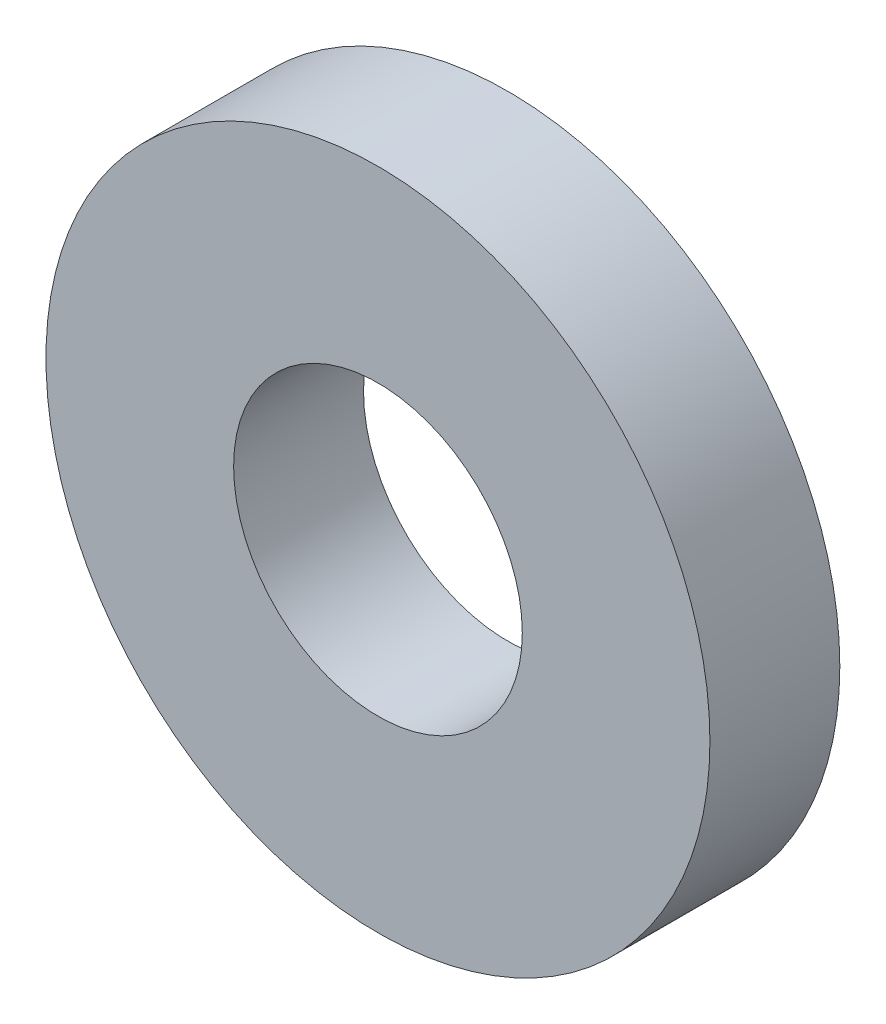
ISO-10303-21;
HEADER;
FILE_DESCRIPTION(('STEP AP214'),'2;1');
FILE_NAME('part.step','',(''),(''),'','','');
FILE_SCHEMA(('AUTOMOTIVE_DESIGN { 1 0 10303 214 1 1 1 1 }'));
ENDSEC;
DATA;
#1=APPLICATION_CONTEXT('core data for automotive mechanical design processes');
#2=APPLICATION_PROTOCOL_DEFINITION('international standard','automotive_design',2000,#1);
#3=PRODUCT_CONTEXT('',#1,'mechanical');
#4=PRODUCT('Part','Part','',(#3));
#5=PRODUCT_RELATED_PRODUCT_CATEGORY('part','',(#4));
#6=PRODUCT_DEFINITION_FORMATION('','',#4);
#7=PRODUCT_DEFINITION_CONTEXT('part definition',#1,'design');
#8=PRODUCT_DEFINITION('design','',#6,#7);
#9=PRODUCT_DEFINITION_SHAPE('','',#8);
#10=(LENGTH_UNIT() NAMED_UNIT(*) SI_UNIT(.MILLI.,.METRE.));
#11=(NAMED_UNIT(*) PLANE_ANGLE_UNIT() SI_UNIT($,.RADIAN.));
#12=(NAMED_UNIT(*) SI_UNIT($,.STERADIAN.) SOLID_ANGLE_UNIT());
#13=UNCERTAINTY_MEASURE_WITH_UNIT(LENGTH_MEASURE(1.E-05),#10,'distance_accuracy_value','');
#14=(GEOMETRIC_REPRESENTATION_CONTEXT(3) GLOBAL_UNCERTAINTY_ASSIGNED_CONTEXT((#13)) GLOBAL_UNIT_ASSIGNED_CONTEXT((#10,
#11,#12)) REPRESENTATION_CONTEXT('',''));
#15=CARTESIAN_POINT('',(0.,0.,0.));
#16=DIRECTION('',(0.,0.,1.));
#17=DIRECTION('',(1.,0.,0.));
#18=AXIS2_PLACEMENT_3D('',#15,#16,#17);
#19=CARTESIAN_POINT('',(0.,0.,9.));
#20=DIRECTION('',(0.,0.,1.));
#21=DIRECTION('',(1.,0.,0.));
#22=AXIS2_PLACEMENT_3D('',#19,#20,#21);
#23=PLANE('',#22);
#24=CARTESIAN_POINT('',(0.,0.,9.));
#25=DIRECTION('',(0.,0.,1.));
#26=DIRECTION('',(1.,0.,0.));
#27=AXIS2_PLACEMENT_3D('',#24,#25,#26);
#28=CIRCLE('',#27,23.);
#29=CARTESIAN_POINT('',(23.,0.,9.));
#30=VERTEX_POINT('',#29);
#31=EDGE_CURVE('E10',#30,#30,#28,.T.);
#32=ORIENTED_EDGE('',*,*,#31,.T.);
#33=EDGE_LOOP('',(#32));
#34=FACE_BOUND('',#33,.T.);
#35=CARTESIAN_POINT('',(0.,0.,9.));
#36=DIRECTION('',(0.,0.,1.));
#37=DIRECTION('',(1.,0.,0.));
#38=AXIS2_PLACEMENT_3D('',#35,#36,#37);
#39=CIRCLE('',#38,10.);
#40=CARTESIAN_POINT('',(10.,0.,9.));
#41=VERTEX_POINT('',#40);
#42=EDGE_CURVE('E46',#41,#41,#39,.T.);
#43=ORIENTED_EDGE('',*,*,#42,.F.);
#44=EDGE_LOOP('',(#43));
#45=FACE_BOUND('',#44,.T.);
#46=ADVANCED_FACE('F35',(#34,#45),#23,.T.);
#47=CARTESIAN_POINT('',(0.,0.,0.));
#48=DIRECTION('',(0.,0.,1.));
#49=DIRECTION('',(1.,0.,0.));
#50=AXIS2_PLACEMENT_3D('',#47,#48,#49);
#51=PLANE('',#50);
#52=CARTESIAN_POINT('',(0.,0.,0.));
#53=DIRECTION('',(0.,0.,1.));
#54=DIRECTION('',(1.,0.,0.));
#55=AXIS2_PLACEMENT_3D('',#52,#53,#54);
#56=CIRCLE('',#55,23.);
#57=CARTESIAN_POINT('',(23.,0.,0.));
#58=VERTEX_POINT('',#57);
#59=EDGE_CURVE('E39',#58,#58,#56,.T.);
#60=ORIENTED_EDGE('',*,*,#59,.F.);
#61=EDGE_LOOP('',(#60));
#62=FACE_BOUND('',#61,.T.);
#63=CARTESIAN_POINT('',(0.,0.,0.));
#64=DIRECTION('',(0.,0.,1.));
#65=DIRECTION('',(1.,0.,0.));
#66=AXIS2_PLACEMENT_3D('',#63,#64,#65);
#67=CIRCLE('',#66,10.);
#68=CARTESIAN_POINT('',(10.,0.,0.));
#69=VERTEX_POINT('',#68);
#70=EDGE_CURVE('E48',#69,#69,#67,.T.);
#71=ORIENTED_EDGE('',*,*,#70,.T.);
#72=EDGE_LOOP('',(#71));
#73=FACE_BOUND('',#72,.T.);
#74=ADVANCED_FACE('F58',(#62,#73),#51,.F.);
#75=CARTESIAN_POINT('',(0.,0.,9.));
#76=DIRECTION('',(0.,0.,-1.));
#77=DIRECTION('',(-1.,0.,0.));
#78=AXIS2_PLACEMENT_3D('',#75,#76,#77);
#79=CYLINDRICAL_SURFACE('',#78,23.);
#80=ORIENTED_EDGE('',*,*,#31,.F.);
#81=EDGE_LOOP('',(#80));
#82=FACE_BOUND('',#81,.T.);
#83=ORIENTED_EDGE('',*,*,#59,.T.);
#84=EDGE_LOOP('',(#83));
#85=FACE_BOUND('',#84,.T.);
#86=ADVANCED_FACE('F37',(#82,#85),#79,.T.);
#87=CARTESIAN_POINT('',(0.,0.,9.));
#88=DIRECTION('',(0.,0.,-1.));
#89=DIRECTION('',(-1.,0.,0.));
#90=AXIS2_PLACEMENT_3D('',#87,#88,#89);
#91=CYLINDRICAL_SURFACE('',#90,10.);
#92=ORIENTED_EDGE('',*,*,#42,.T.);
#93=EDGE_LOOP('',(#92));
#94=FACE_BOUND('',#93,.T.);
#95=ORIENTED_EDGE('',*,*,#70,.F.);
#96=EDGE_LOOP('',(#95));
#97=FACE_BOUND('',#96,.T.);
#98=ADVANCED_FACE('F54',(#94,#97),#91,.F.);
#99=CLOSED_SHELL('',(#46,#74,#86,#98));
#100=MANIFOLD_SOLID_BREP('B2',#99);
#101=ADVANCED_BREP_SHAPE_REPRESENTATION('',(#18,#100),#14);
#102=SHAPE_DEFINITION_REPRESENTATION(#9,#101);
ENDSEC;
END-ISO-10303-21;
